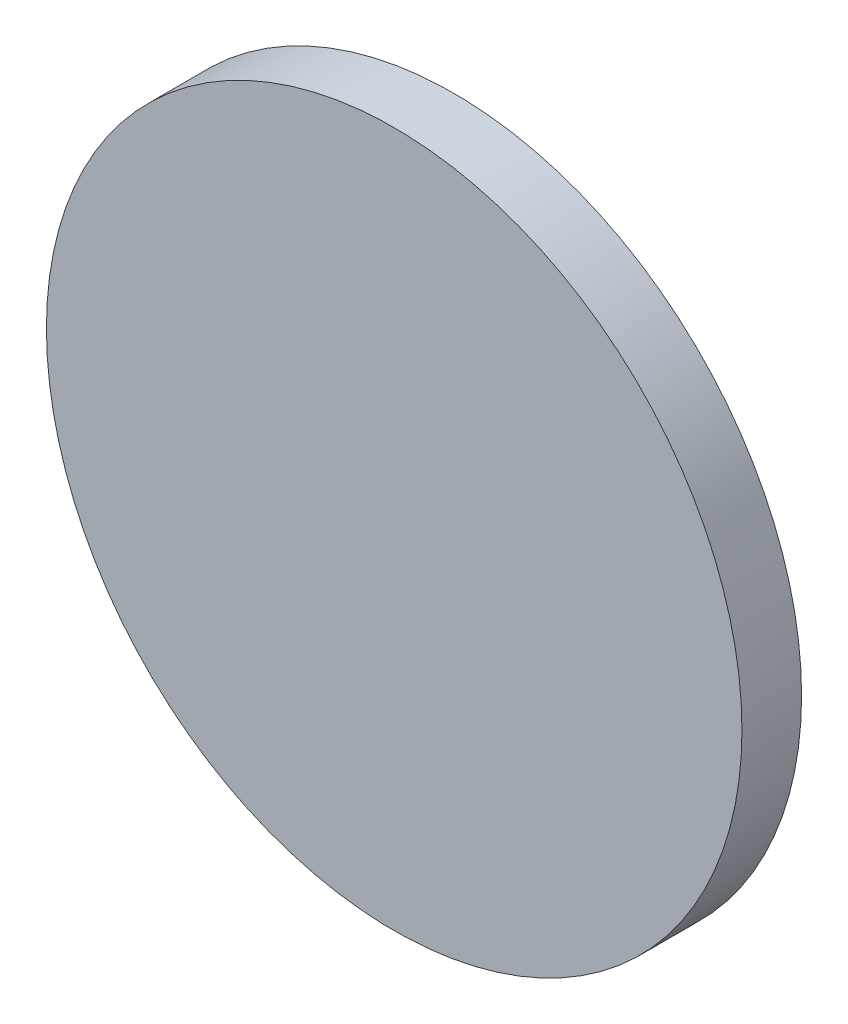
ISO-10303-21;
HEADER;
FILE_DESCRIPTION(('STEP AP214'),'2;1');
FILE_NAME('part.step','',(''),(''),'','','');
FILE_SCHEMA(('AUTOMOTIVE_DESIGN { 1 0 10303 214 1 1 1 1 }'));
ENDSEC;
DATA;
#1=APPLICATION_CONTEXT('core data for automotive mechanical design processes');
#2=APPLICATION_PROTOCOL_DEFINITION('international standard','automotive_design',2000,#1);
#3=PRODUCT_CONTEXT('',#1,'mechanical');
#4=PRODUCT('Part','Part','',(#3));
#5=PRODUCT_RELATED_PRODUCT_CATEGORY('part','',(#4));
#6=PRODUCT_DEFINITION_FORMATION('','',#4);
#7=PRODUCT_DEFINITION_CONTEXT('part definition',#1,'design');
#8=PRODUCT_DEFINITION('design','',#6,#7);
#9=PRODUCT_DEFINITION_SHAPE('','',#8);
#10=(LENGTH_UNIT() NAMED_UNIT(*) SI_UNIT(.MILLI.,.METRE.));
#11=(NAMED_UNIT(*) PLANE_ANGLE_UNIT() SI_UNIT($,.RADIAN.));
#12=(NAMED_UNIT(*) SI_UNIT($,.STERADIAN.) SOLID_ANGLE_UNIT());
#13=UNCERTAINTY_MEASURE_WITH_UNIT(LENGTH_MEASURE(1.E-05),#10,'distance_accuracy_value','');
#14=(GEOMETRIC_REPRESENTATION_CONTEXT(3) GLOBAL_UNCERTAINTY_ASSIGNED_CONTEXT((#13)) GLOBAL_UNIT_ASSIGNED_CONTEXT((#10,
#11,#12)) REPRESENTATION_CONTEXT('',''));
#15=CARTESIAN_POINT('',(0.,0.,0.));
#16=DIRECTION('',(0.,0.,1.));
#17=DIRECTION('',(1.,0.,0.));
#18=AXIS2_PLACEMENT_3D('',#15,#16,#17);
#19=CARTESIAN_POINT('',(11.18,1.973000014875,0.79916));
#20=DIRECTION('',(0.,0.,1.));
#21=DIRECTION('',(1.,0.,0.));
#22=AXIS2_PLACEMENT_3D('',#19,#20,#21);
#23=PLANE('',#22);
#24=CARTESIAN_POINT('',(11.18,1.973000014875,0.79916));
#25=DIRECTION('',(0.,0.,1.));
#26=DIRECTION('',(1.,0.,0.));
#27=AXIS2_PLACEMENT_3D('',#24,#25,#26);
#28=CIRCLE('',#27,0.200024667);
#29=CARTESIAN_POINT('',(11.380024667,1.973000014875,0.79916));
#30=VERTEX_POINT('',#29);
#31=EDGE_CURVE('E18',#30,#30,#28,.F.);
#32=ORIENTED_EDGE('',*,*,#31,.F.);
#33=EDGE_LOOP('',(#32));
#34=FACE_BOUND('',#33,.T.);
#35=ADVANCED_FACE('F15',(#34),#23,.T.);
#36=CARTESIAN_POINT('',(11.18,1.973000014875,0.76487));
#37=DIRECTION('',(0.,0.,1.));
#38=DIRECTION('',(1.,0.,0.));
#39=AXIS2_PLACEMENT_3D('',#36,#37,#38);
#40=CYLINDRICAL_SURFACE('',#39,0.200024667);
#41=ORIENTED_EDGE('',*,*,#31,.T.);
#42=EDGE_LOOP('',(#41));
#43=FACE_BOUND('',#42,.T.);
#44=CARTESIAN_POINT('',(11.18,1.973000014875,0.76487));
#45=DIRECTION('',(0.,0.,1.));
#46=DIRECTION('',(1.,0.,0.));
#47=AXIS2_PLACEMENT_3D('',#44,#45,#46);
#48=CIRCLE('',#47,0.200024667);
#49=CARTESIAN_POINT('',(11.380024667,1.973000014875,0.76487));
#50=VERTEX_POINT('',#49);
#51=EDGE_CURVE('E10',#50,#50,#48,.F.);
#52=ORIENTED_EDGE('',*,*,#51,.F.);
#53=EDGE_LOOP('',(#52));
#54=FACE_BOUND('',#53,.T.);
#55=ADVANCED_FACE('F27',(#43,#54),#40,.T.);
#56=CARTESIAN_POINT('',(11.18,1.973000014875,0.76487));
#57=DIRECTION('',(0.,0.,-1.));
#58=DIRECTION('',(-1.,0.,0.));
#59=AXIS2_PLACEMENT_3D('',#56,#57,#58);
#60=PLANE('',#59);
#61=ORIENTED_EDGE('',*,*,#51,.T.);
#62=EDGE_LOOP('',(#61));
#63=FACE_BOUND('',#62,.T.);
#64=ADVANCED_FACE('F35',(#63),#60,.T.);
#65=CLOSED_SHELL('',(#35,#55,#64));
#66=MANIFOLD_SOLID_BREP('B1',#65);
#67=ADVANCED_BREP_SHAPE_REPRESENTATION('',(#18,#66),#14);
#68=SHAPE_DEFINITION_REPRESENTATION(#9,#67);
ENDSEC;
END-ISO-10303-21;
